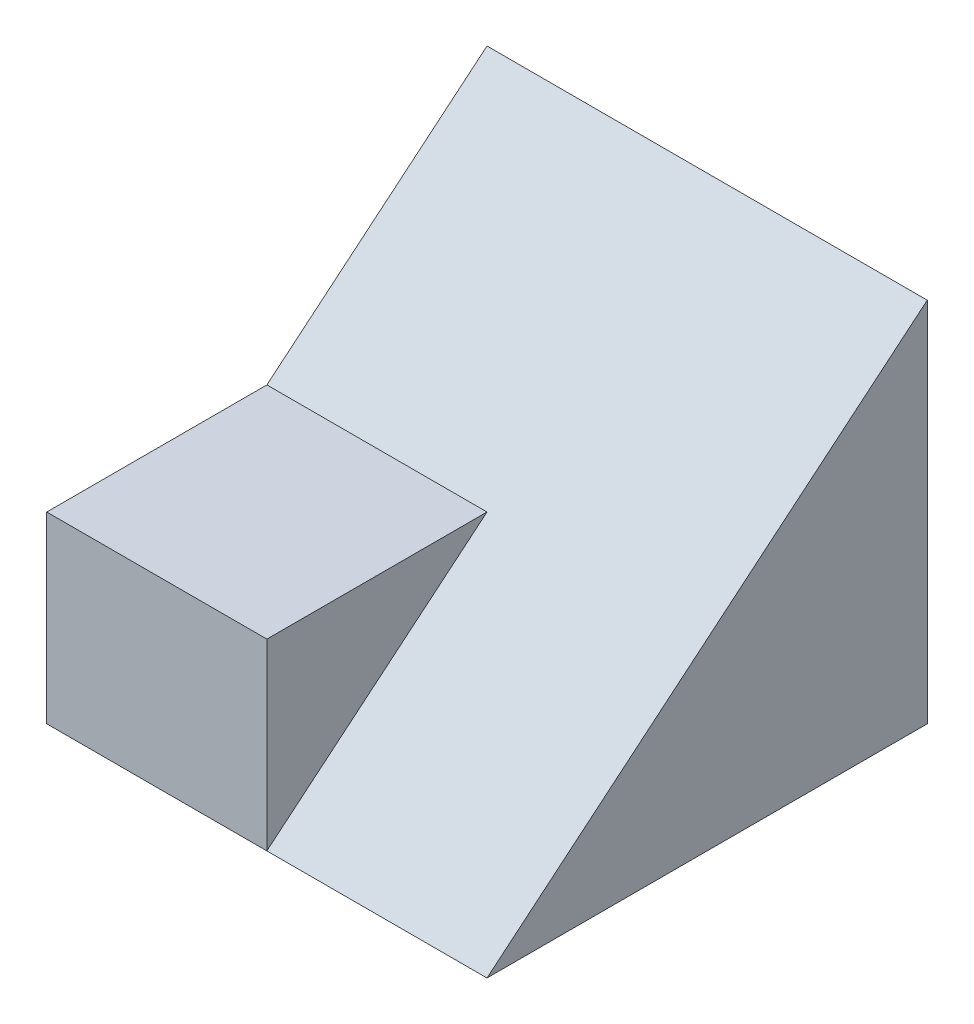
ISO-10303-21;
HEADER;
FILE_DESCRIPTION(('STEP AP214'),'2;1');
FILE_NAME('part.step','',(''),(''),'','','');
FILE_SCHEMA(('AUTOMOTIVE_DESIGN { 1 0 10303 214 1 1 1 1 }'));
ENDSEC;
DATA;
#1=APPLICATION_CONTEXT('core data for automotive mechanical design processes');
#2=APPLICATION_PROTOCOL_DEFINITION('international standard','automotive_design',2000,#1);
#3=PRODUCT_CONTEXT('',#1,'mechanical');
#4=PRODUCT('Part','Part','',(#3));
#5=PRODUCT_RELATED_PRODUCT_CATEGORY('part','',(#4));
#6=PRODUCT_DEFINITION_FORMATION('','',#4);
#7=PRODUCT_DEFINITION_CONTEXT('part definition',#1,'design');
#8=PRODUCT_DEFINITION('design','',#6,#7);
#9=PRODUCT_DEFINITION_SHAPE('','',#8);
#10=(LENGTH_UNIT() NAMED_UNIT(*) SI_UNIT(.MILLI.,.METRE.));
#11=(NAMED_UNIT(*) PLANE_ANGLE_UNIT() SI_UNIT($,.RADIAN.));
#12=(NAMED_UNIT(*) SI_UNIT($,.STERADIAN.) SOLID_ANGLE_UNIT());
#13=UNCERTAINTY_MEASURE_WITH_UNIT(LENGTH_MEASURE(1.E-05),#10,'distance_accuracy_value','');
#14=(GEOMETRIC_REPRESENTATION_CONTEXT(3) GLOBAL_UNCERTAINTY_ASSIGNED_CONTEXT((#13)) GLOBAL_UNIT_ASSIGNED_CONTEXT((#10,
#11,#12)) REPRESENTATION_CONTEXT('',''));
#15=CARTESIAN_POINT('',(0.,0.,0.));
#16=DIRECTION('',(0.,0.,1.));
#17=DIRECTION('',(1.,0.,0.));
#18=AXIS2_PLACEMENT_3D('',#15,#16,#17);
#19=CARTESIAN_POINT('',(3.,5.,3.));
#20=DIRECTION('',(-1.,0.,0.));
#21=DIRECTION('',(0.,0.,1.));
#22=AXIS2_PLACEMENT_3D('',#19,#20,#21);
#23=PLANE('',#22);
#24=DIRECTION('',(0.,-0.64018439966448,0.768221279597376));
#25=VECTOR('',#24,1.);
#26=CARTESIAN_POINT('',(3.,2.04918032786885,0.540983606557377));
#27=LINE('',#26,#25);
#28=CARTESIAN_POINT('',(3.,5.,-3.));
#29=VERTEX_POINT('',#28);
#30=CARTESIAN_POINT('',(3.,0.,3.));
#31=VERTEX_POINT('',#30);
#32=EDGE_CURVE('E48',#29,#31,#27,.T.);
#33=ORIENTED_EDGE('',*,*,#32,.T.);
#34=DIRECTION('',(0.,0.,-1.));
#35=VECTOR('',#34,1.);
#36=CARTESIAN_POINT('',(3.,0.,3.));
#37=LINE('',#36,#35);
#38=CARTESIAN_POINT('',(3.,0.,-3.));
#39=VERTEX_POINT('',#38);
#40=EDGE_CURVE('E70',#31,#39,#37,.T.);
#41=ORIENTED_EDGE('',*,*,#40,.T.);
#42=DIRECTION('',(0.,-1.,0.));
#43=VECTOR('',#42,1.);
#44=CARTESIAN_POINT('',(3.,5.,-3.));
#45=LINE('',#44,#43);
#46=EDGE_CURVE('E11',#29,#39,#45,.T.);
#47=ORIENTED_EDGE('',*,*,#46,.F.);
#48=EDGE_LOOP('',(#33,#41,#47));
#49=FACE_BOUND('',#48,.T.);
#50=ADVANCED_FACE('F33',(#49),#23,.F.);
#51=CARTESIAN_POINT('',(-3.,5.,3.));
#52=DIRECTION('',(0.,0.,-1.));
#53=DIRECTION('',(-1.,0.,0.));
#54=AXIS2_PLACEMENT_3D('',#51,#52,#53);
#55=PLANE('',#54);
#56=DIRECTION('',(0.,-1.,0.));
#57=VECTOR('',#56,1.);
#58=CARTESIAN_POINT('',(0.,0.,3.));
#59=LINE('',#58,#57);
#60=CARTESIAN_POINT('',(0.,2.5,3.));
#61=VERTEX_POINT('',#60);
#62=CARTESIAN_POINT('',(0.,0.,3.));
#63=VERTEX_POINT('',#62);
#64=EDGE_CURVE('E112',#61,#63,#59,.T.);
#65=ORIENTED_EDGE('',*,*,#64,.F.);
#66=DIRECTION('',(-1.,0.,0.));
#67=VECTOR('',#66,1.);
#68=CARTESIAN_POINT('',(7.,2.5,3.));
#69=LINE('',#68,#67);
#70=CARTESIAN_POINT('',(-3.,2.5,3.));
#71=VERTEX_POINT('',#70);
#72=EDGE_CURVE('E97',#61,#71,#69,.T.);
#73=ORIENTED_EDGE('',*,*,#72,.T.);
#74=DIRECTION('',(0.,-1.,0.));
#75=VECTOR('',#74,1.);
#76=CARTESIAN_POINT('',(-3.,5.,3.));
#77=LINE('',#76,#75);
#78=CARTESIAN_POINT('',(-3.,0.,3.));
#79=VERTEX_POINT('',#78);
#80=EDGE_CURVE('E81',#71,#79,#77,.T.);
#81=ORIENTED_EDGE('',*,*,#80,.T.);
#82=DIRECTION('',(1.,0.,0.));
#83=VECTOR('',#82,1.);
#84=CARTESIAN_POINT('',(-3.,0.,3.));
#85=LINE('',#84,#83);
#86=EDGE_CURVE('E85',#79,#63,#85,.T.);
#87=ORIENTED_EDGE('',*,*,#86,.T.);
#88=EDGE_LOOP('',(#65,#73,#81,#87));
#89=FACE_BOUND('',#88,.T.);
#90=ADVANCED_FACE('F131',(#89),#55,.F.);
#91=CARTESIAN_POINT('',(7.,2.5,0.));
#92=DIRECTION('',(0.,-1.,0.));
#93=DIRECTION('',(0.,0.,-1.));
#94=AXIS2_PLACEMENT_3D('',#91,#92,#93);
#95=PLANE('',#94);
#96=DIRECTION('',(0.,0.,1.));
#97=VECTOR('',#96,1.);
#98=CARTESIAN_POINT('',(0.,2.5,0.));
#99=LINE('',#98,#97);
#100=CARTESIAN_POINT('',(0.,2.5,0.));
#101=VERTEX_POINT('',#100);
#102=EDGE_CURVE('E115',#101,#61,#99,.T.);
#103=ORIENTED_EDGE('',*,*,#102,.F.);
#104=DIRECTION('',(-1.,0.,0.));
#105=VECTOR('',#104,1.);
#106=CARTESIAN_POINT('',(7.,2.5,0.));
#107=LINE('',#106,#105);
#108=CARTESIAN_POINT('',(-3.,2.5,0.));
#109=VERTEX_POINT('',#108);
#110=EDGE_CURVE('E99',#101,#109,#107,.T.);
#111=ORIENTED_EDGE('',*,*,#110,.T.);
#112=DIRECTION('',(0.,0.,1.));
#113=VECTOR('',#112,1.);
#114=CARTESIAN_POINT('',(-3.,2.5,0.));
#115=LINE('',#114,#113);
#116=EDGE_CURVE('E106',#109,#71,#115,.T.);
#117=ORIENTED_EDGE('',*,*,#116,.T.);
#118=ORIENTED_EDGE('',*,*,#72,.F.);
#119=EDGE_LOOP('',(#103,#111,#117,#118));
#120=FACE_BOUND('',#119,.T.);
#121=ADVANCED_FACE('F133',(#120),#95,.F.);
#122=CARTESIAN_POINT('',(-3.,5.,-3.));
#123=DIRECTION('',(0.,0.,1.));
#124=DIRECTION('',(1.,0.,0.));
#125=AXIS2_PLACEMENT_3D('',#122,#123,#124);
#126=PLANE('',#125);
#127=DIRECTION('',(-1.,0.,0.));
#128=VECTOR('',#127,1.);
#129=CARTESIAN_POINT('',(-3.,0.,-3.));
#130=LINE('',#129,#128);
#131=CARTESIAN_POINT('',(-3.,0.,-3.));
#132=VERTEX_POINT('',#131);
#133=EDGE_CURVE('E61',#39,#132,#130,.T.);
#134=ORIENTED_EDGE('',*,*,#133,.T.);
#135=DIRECTION('',(0.,-1.,0.));
#136=VECTOR('',#135,1.);
#137=CARTESIAN_POINT('',(-3.,5.,-3.));
#138=LINE('',#137,#136);
#139=CARTESIAN_POINT('',(-3.,5.,-3.));
#140=VERTEX_POINT('',#139);
#141=EDGE_CURVE('E41',#140,#132,#138,.T.);
#142=ORIENTED_EDGE('',*,*,#141,.F.);
#143=DIRECTION('',(-1.,0.,0.));
#144=VECTOR('',#143,1.);
#145=CARTESIAN_POINT('',(-3.,5.,-3.));
#146=LINE('',#145,#144);
#147=EDGE_CURVE('E87',#29,#140,#146,.T.);
#148=ORIENTED_EDGE('',*,*,#147,.F.);
#149=ORIENTED_EDGE('',*,*,#46,.T.);
#150=EDGE_LOOP('',(#134,#142,#148,#149));
#151=FACE_BOUND('',#150,.T.);
#152=ADVANCED_FACE('F63',(#151),#126,.F.);
#153=CARTESIAN_POINT('',(-3.,5.,3.));
#154=DIRECTION('',(1.,0.,0.));
#155=DIRECTION('',(0.,0.,-1.));
#156=AXIS2_PLACEMENT_3D('',#153,#154,#155);
#157=PLANE('',#156);
#158=ORIENTED_EDGE('',*,*,#116,.F.);
#159=DIRECTION('',(0.,-0.64018439966448,0.768221279597376));
#160=VECTOR('',#159,1.);
#161=CARTESIAN_POINT('',(-3.,1.47540983606557,1.22950819672131));
#162=LINE('',#161,#160);
#163=EDGE_CURVE('E80',#140,#109,#162,.T.);
#164=ORIENTED_EDGE('',*,*,#163,.F.);
#165=ORIENTED_EDGE('',*,*,#141,.T.);
#166=DIRECTION('',(0.,0.,1.));
#167=VECTOR('',#166,1.);
#168=CARTESIAN_POINT('',(-3.,0.,3.));
#169=LINE('',#168,#167);
#170=EDGE_CURVE('E69',#132,#79,#169,.T.);
#171=ORIENTED_EDGE('',*,*,#170,.T.);
#172=ORIENTED_EDGE('',*,*,#80,.F.);
#173=EDGE_LOOP('',(#158,#164,#165,#171,#172));
#174=FACE_BOUND('',#173,.T.);
#175=ADVANCED_FACE('F76',(#174),#157,.F.);
#176=CARTESIAN_POINT('',(0.,0.,0.));
#177=DIRECTION('',(0.,-1.,0.));
#178=DIRECTION('',(0.,0.,-1.));
#179=AXIS2_PLACEMENT_3D('',#176,#177,#178);
#180=PLANE('',#179);
#181=ORIENTED_EDGE('',*,*,#40,.F.);
#182=DIRECTION('',(1.,0.,0.));
#183=VECTOR('',#182,1.);
#184=CARTESIAN_POINT('',(0.,0.,3.));
#185=LINE('',#184,#183);
#186=EDGE_CURVE('E110',#63,#31,#185,.T.);
#187=ORIENTED_EDGE('',*,*,#186,.F.);
#188=ORIENTED_EDGE('',*,*,#86,.F.);
#189=ORIENTED_EDGE('',*,*,#170,.F.);
#190=ORIENTED_EDGE('',*,*,#133,.F.);
#191=EDGE_LOOP('',(#181,#187,#188,#189,#190));
#192=FACE_BOUND('',#191,.T.);
#193=ADVANCED_FACE('F82',(#192),#180,.T.);
#194=CARTESIAN_POINT('',(7.,1.47540983606557,1.22950819672131));
#195=DIRECTION('',(0.,-0.768221279597376,-0.64018439966448));
#196=DIRECTION('',(0.,0.64018439966448,-0.768221279597376));
#197=AXIS2_PLACEMENT_3D('',#194,#195,#196);
#198=PLANE('',#197);
#199=ORIENTED_EDGE('',*,*,#147,.T.);
#200=ORIENTED_EDGE('',*,*,#163,.T.);
#201=ORIENTED_EDGE('',*,*,#110,.F.);
#202=DIRECTION('',(0.,-0.64018439966448,0.768221279597376));
#203=VECTOR('',#202,1.);
#204=CARTESIAN_POINT('',(0.,1.47540983606557,1.22950819672131));
#205=LINE('',#204,#203);
#206=EDGE_CURVE('E118',#101,#63,#205,.T.);
#207=ORIENTED_EDGE('',*,*,#206,.T.);
#208=ORIENTED_EDGE('',*,*,#186,.T.);
#209=ORIENTED_EDGE('',*,*,#32,.F.);
#210=EDGE_LOOP('',(#199,#200,#201,#207,#208,#209));
#211=FACE_BOUND('',#210,.T.);
#212=ADVANCED_FACE('F123',(#211),#198,.F.);
#213=CARTESIAN_POINT('',(0.,0.,0.));
#214=DIRECTION('',(1.,0.,0.));
#215=DIRECTION('',(0.,0.,-1.));
#216=AXIS2_PLACEMENT_3D('',#213,#214,#215);
#217=PLANE('',#216);
#218=ORIENTED_EDGE('',*,*,#206,.F.);
#219=ORIENTED_EDGE('',*,*,#102,.T.);
#220=ORIENTED_EDGE('',*,*,#64,.T.);
#221=EDGE_LOOP('',(#218,#219,#220));
#222=FACE_BOUND('',#221,.T.);
#223=ADVANCED_FACE('F130',(#222),#217,.T.);
#224=CLOSED_SHELL('',(#50,#90,#121,#152,#175,#193,#212,#223));
#225=MANIFOLD_SOLID_BREP('B2',#224);
#226=ADVANCED_BREP_SHAPE_REPRESENTATION('',(#18,#225),#14);
#227=SHAPE_DEFINITION_REPRESENTATION(#9,#226);
ENDSEC;
END-ISO-10303-21;
